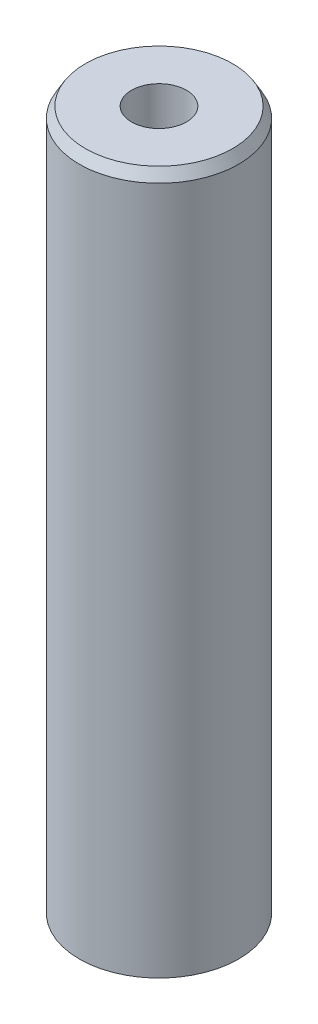
ISO-10303-21;
HEADER;
FILE_DESCRIPTION(('STEP AP214'),'2;1');
FILE_NAME('part.step','',(''),(''),'','','');
FILE_SCHEMA(('AUTOMOTIVE_DESIGN { 1 0 10303 214 1 1 1 1 }'));
ENDSEC;
DATA;
#1=APPLICATION_CONTEXT('core data for automotive mechanical design processes');
#2=APPLICATION_PROTOCOL_DEFINITION('international standard','automotive_design',2000,#1);
#3=PRODUCT_CONTEXT('',#1,'mechanical');
#4=PRODUCT('Part','Part','',(#3));
#5=PRODUCT_RELATED_PRODUCT_CATEGORY('part','',(#4));
#6=PRODUCT_DEFINITION_FORMATION('','',#4);
#7=PRODUCT_DEFINITION_CONTEXT('part definition',#1,'design');
#8=PRODUCT_DEFINITION('design','',#6,#7);
#9=PRODUCT_DEFINITION_SHAPE('','',#8);
#10=(LENGTH_UNIT() NAMED_UNIT(*) SI_UNIT(.MILLI.,.METRE.));
#11=(NAMED_UNIT(*) PLANE_ANGLE_UNIT() SI_UNIT($,.RADIAN.));
#12=(NAMED_UNIT(*) SI_UNIT($,.STERADIAN.) SOLID_ANGLE_UNIT());
#13=UNCERTAINTY_MEASURE_WITH_UNIT(LENGTH_MEASURE(1.E-05),#10,'distance_accuracy_value','');
#14=(GEOMETRIC_REPRESENTATION_CONTEXT(3) GLOBAL_UNCERTAINTY_ASSIGNED_CONTEXT((#13)) GLOBAL_UNIT_ASSIGNED_CONTEXT((#10,
#11,#12)) REPRESENTATION_CONTEXT('',''));
#15=CARTESIAN_POINT('',(0.,0.,0.));
#16=DIRECTION('',(0.,0.,1.));
#17=DIRECTION('',(1.,0.,0.));
#18=AXIS2_PLACEMENT_3D('',#15,#16,#17);
#19=CARTESIAN_POINT('',(0.,221.12984244355,0.));
#20=DIRECTION('',(0.,-1.,0.));
#21=DIRECTION('',(0.,0.,-1.));
#22=AXIS2_PLACEMENT_3D('',#19,#20,#21);
#23=CYLINDRICAL_SURFACE('',#22,25.);
#24=CARTESIAN_POINT('',(0.,217.835669870894,0.));
#25=DIRECTION('',(0.,1.,0.));
#26=DIRECTION('',(0.,0.,1.));
#27=AXIS2_PLACEMENT_3D('',#24,#25,#26);
#28=CIRCLE('',#27,25.);
#29=CARTESIAN_POINT('',(0.,217.835669870894,25.));
#30=VERTEX_POINT('',#29);
#31=EDGE_CURVE('E50',#30,#30,#28,.F.);
#32=ORIENTED_EDGE('',*,*,#31,.T.);
#33=EDGE_LOOP('',(#32));
#34=FACE_BOUND('',#33,.T.);
#35=CARTESIAN_POINT('',(0.,1.90189142158037,0.));
#36=DIRECTION('',(0.,1.,0.));
#37=DIRECTION('',(0.,0.,1.));
#38=AXIS2_PLACEMENT_3D('',#35,#36,#37);
#39=CIRCLE('',#38,25.);
#40=CARTESIAN_POINT('',(0.,1.90189142158037,25.));
#41=VERTEX_POINT('',#40);
#42=EDGE_CURVE('E51',#41,#41,#39,.T.);
#43=ORIENTED_EDGE('',*,*,#42,.T.);
#44=EDGE_LOOP('',(#43));
#45=FACE_BOUND('',#44,.T.);
#46=ADVANCED_FACE('F39',(#34,#45),#23,.T.);
#47=CARTESIAN_POINT('',(0.,221.12984244355,0.));
#48=DIRECTION('',(0.,1.,0.));
#49=DIRECTION('',(0.,0.,1.));
#50=AXIS2_PLACEMENT_3D('',#47,#48,#49);
#51=PLANE('',#50);
#52=CARTESIAN_POINT('',(0.,221.12984244355,0.));
#53=DIRECTION('',(0.,1.,0.));
#54=DIRECTION('',(0.,0.,1.));
#55=AXIS2_PLACEMENT_3D('',#52,#53,#54);
#56=CIRCLE('',#55,23.0981085784197);
#57=CARTESIAN_POINT('',(0.,221.12984244355,23.0981085784197));
#58=VERTEX_POINT('',#57);
#59=EDGE_CURVE('E54',#58,#58,#56,.T.);
#60=ORIENTED_EDGE('',*,*,#59,.T.);
#61=EDGE_LOOP('',(#60));
#62=FACE_BOUND('',#61,.T.);
#63=CARTESIAN_POINT('',(0.,221.12984244355,0.));
#64=DIRECTION('',(0.,1.,0.));
#65=DIRECTION('',(0.,0.,1.));
#66=AXIS2_PLACEMENT_3D('',#63,#64,#65);
#67=CIRCLE('',#66,8.62735007275126);
#68=CARTESIAN_POINT('',(0.,221.12984244355,8.62735007275126));
#69=VERTEX_POINT('',#68);
#70=EDGE_CURVE('E58',#69,#69,#67,.T.);
#71=ORIENTED_EDGE('',*,*,#70,.F.);
#72=EDGE_LOOP('',(#71));
#73=FACE_BOUND('',#72,.T.);
#74=ADVANCED_FACE('F69',(#62,#73),#51,.T.);
#75=CARTESIAN_POINT('',(0.,0.,0.));
#76=DIRECTION('',(0.,1.,0.));
#77=DIRECTION('',(0.,0.,1.));
#78=AXIS2_PLACEMENT_3D('',#75,#76,#77);
#79=PLANE('',#78);
#80=CARTESIAN_POINT('',(0.,0.,0.));
#81=DIRECTION('',(0.,1.,0.));
#82=DIRECTION('',(0.,0.,1.));
#83=AXIS2_PLACEMENT_3D('',#80,#81,#82);
#84=CIRCLE('',#83,21.7058274273434);
#85=CARTESIAN_POINT('',(0.,0.,21.7058274273434));
#86=VERTEX_POINT('',#85);
#87=EDGE_CURVE('E10',#86,#86,#84,.F.);
#88=ORIENTED_EDGE('',*,*,#87,.T.);
#89=EDGE_LOOP('',(#88));
#90=FACE_BOUND('',#89,.T.);
#91=CARTESIAN_POINT('',(0.,0.,0.));
#92=DIRECTION('',(0.,1.,0.));
#93=DIRECTION('',(0.,0.,1.));
#94=AXIS2_PLACEMENT_3D('',#91,#92,#93);
#95=CIRCLE('',#94,8.62735007275126);
#96=CARTESIAN_POINT('',(0.,0.,8.62735007275126));
#97=VERTEX_POINT('',#96);
#98=EDGE_CURVE('E63',#97,#97,#95,.T.);
#99=ORIENTED_EDGE('',*,*,#98,.T.);
#100=EDGE_LOOP('',(#99));
#101=FACE_BOUND('',#100,.T.);
#102=ADVANCED_FACE('F75',(#90,#101),#79,.F.);
#103=CARTESIAN_POINT('',(0.,221.12984244355,0.));
#104=DIRECTION('',(0.,-1.,0.));
#105=DIRECTION('',(0.,0.,-1.));
#106=AXIS2_PLACEMENT_3D('',#103,#104,#105);
#107=CYLINDRICAL_SURFACE('',#106,8.62735007275126);
#108=ORIENTED_EDGE('',*,*,#70,.T.);
#109=EDGE_LOOP('',(#108));
#110=FACE_BOUND('',#109,.T.);
#111=ORIENTED_EDGE('',*,*,#98,.F.);
#112=EDGE_LOOP('',(#111));
#113=FACE_BOUND('',#112,.T.);
#114=ADVANCED_FACE('F70',(#110,#113),#107,.F.);
#115=CARTESIAN_POINT('',(0.,221.12984244355,0.));
#116=DIRECTION('',(0.,-1.,0.));
#117=DIRECTION('',(0.,0.,-1.));
#118=AXIS2_PLACEMENT_3D('',#115,#116,#117);
#119=CONICAL_SURFACE('',#118,23.0981085784197,0.523598775598298);
#120=ORIENTED_EDGE('',*,*,#31,.F.);
#121=EDGE_LOOP('',(#120));
#122=FACE_BOUND('',#121,.T.);
#123=ORIENTED_EDGE('',*,*,#59,.F.);
#124=EDGE_LOOP('',(#123));
#125=FACE_BOUND('',#124,.T.);
#126=ADVANCED_FACE('F81',(#122,#125),#119,.T.);
#127=CARTESIAN_POINT('',(0.,1.90189142158037,0.));
#128=DIRECTION('',(0.,1.,0.));
#129=DIRECTION('',(0.,0.,1.));
#130=AXIS2_PLACEMENT_3D('',#127,#128,#129);
#131=CONICAL_SURFACE('',#130,25.,1.0471975511966);
#132=ORIENTED_EDGE('',*,*,#87,.F.);
#133=EDGE_LOOP('',(#132));
#134=FACE_BOUND('',#133,.T.);
#135=ORIENTED_EDGE('',*,*,#42,.F.);
#136=EDGE_LOOP('',(#135));
#137=FACE_BOUND('',#136,.T.);
#138=ADVANCED_FACE('F45',(#134,#137),#131,.T.);
#139=CLOSED_SHELL('',(#46,#74,#102,#114,#126,#138));
#140=MANIFOLD_SOLID_BREP('B2',#139);
#141=ADVANCED_BREP_SHAPE_REPRESENTATION('',(#18,#140),#14);
#142=SHAPE_DEFINITION_REPRESENTATION(#9,#141);
ENDSEC;
END-ISO-10303-21;
